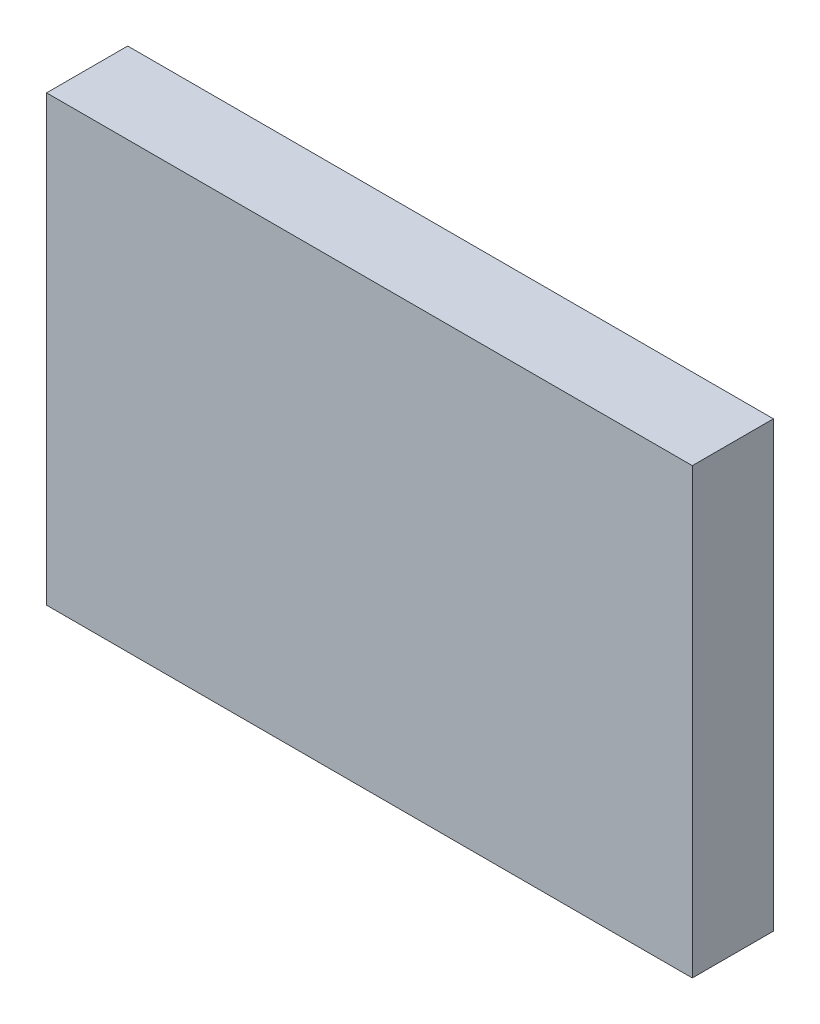
ISO-10303-21;
HEADER;
FILE_DESCRIPTION(('STEP AP214'),'2;1');
FILE_NAME('part.step','',(''),(''),'','','');
FILE_SCHEMA(('AUTOMOTIVE_DESIGN { 1 0 10303 214 1 1 1 1 }'));
ENDSEC;
DATA;
#1=APPLICATION_CONTEXT('core data for automotive mechanical design processes');
#2=APPLICATION_PROTOCOL_DEFINITION('international standard','automotive_design',2000,#1);
#3=PRODUCT_CONTEXT('',#1,'mechanical');
#4=PRODUCT('Part','Part','',(#3));
#5=PRODUCT_RELATED_PRODUCT_CATEGORY('part','',(#4));
#6=PRODUCT_DEFINITION_FORMATION('','',#4);
#7=PRODUCT_DEFINITION_CONTEXT('part definition',#1,'design');
#8=PRODUCT_DEFINITION('design','',#6,#7);
#9=PRODUCT_DEFINITION_SHAPE('','',#8);
#10=(LENGTH_UNIT() NAMED_UNIT(*) SI_UNIT(.MILLI.,.METRE.));
#11=(NAMED_UNIT(*) PLANE_ANGLE_UNIT() SI_UNIT($,.RADIAN.));
#12=(NAMED_UNIT(*) SI_UNIT($,.STERADIAN.) SOLID_ANGLE_UNIT());
#13=UNCERTAINTY_MEASURE_WITH_UNIT(LENGTH_MEASURE(1.E-05),#10,'distance_accuracy_value','');
#14=(GEOMETRIC_REPRESENTATION_CONTEXT(3) GLOBAL_UNCERTAINTY_ASSIGNED_CONTEXT((#13)) GLOBAL_UNIT_ASSIGNED_CONTEXT((#10,
#11,#12)) REPRESENTATION_CONTEXT('',''));
#15=CARTESIAN_POINT('',(0.,0.,0.));
#16=DIRECTION('',(0.,0.,1.));
#17=DIRECTION('',(1.,0.,0.));
#18=AXIS2_PLACEMENT_3D('',#15,#16,#17);
#19=CARTESIAN_POINT('',(-1.549,-1.054,0.));
#20=DIRECTION('',(0.,-1.,0.));
#21=DIRECTION('',(0.,0.,-1.));
#22=AXIS2_PLACEMENT_3D('',#19,#20,#21);
#23=PLANE('',#22);
#24=DIRECTION('',(-1.,0.,0.));
#25=VECTOR('',#24,1.);
#26=CARTESIAN_POINT('',(-1.143,-1.054,0.));
#27=LINE('',#26,#25);
#28=CARTESIAN_POINT('',(-1.143,-1.054,0.));
#29=VERTEX_POINT('',#28);
#30=CARTESIAN_POINT('',(-1.549,-1.054,0.));
#31=VERTEX_POINT('',#30);
#32=EDGE_CURVE('E11',#29,#31,#27,.T.);
#33=ORIENTED_EDGE('',*,*,#32,.F.);
#34=DIRECTION('',(0.,0.,-1.));
#35=VECTOR('',#34,1.);
#36=CARTESIAN_POINT('',(-1.143,-1.054,0.051));
#37=LINE('',#36,#35);
#38=CARTESIAN_POINT('',(-1.143,-1.054,0.051));
#39=VERTEX_POINT('',#38);
#40=EDGE_CURVE('E24',#39,#29,#37,.T.);
#41=ORIENTED_EDGE('',*,*,#40,.F.);
#42=DIRECTION('',(1.,0.,0.));
#43=VECTOR('',#42,1.);
#44=CARTESIAN_POINT('',(-1.549,-1.054,0.051));
#45=LINE('',#44,#43);
#46=CARTESIAN_POINT('',(-1.549,-1.054,0.051));
#47=VERTEX_POINT('',#46);
#48=EDGE_CURVE('E88',#47,#39,#45,.T.);
#49=ORIENTED_EDGE('',*,*,#48,.F.);
#50=DIRECTION('',(0.,0.,1.));
#51=VECTOR('',#50,1.);
#52=CARTESIAN_POINT('',(-1.549,-1.054,0.));
#53=LINE('',#52,#51);
#54=EDGE_CURVE('E77',#31,#47,#53,.T.);
#55=ORIENTED_EDGE('',*,*,#54,.F.);
#56=EDGE_LOOP('',(#33,#41,#49,#55));
#57=FACE_BOUND('',#56,.T.);
#58=ADVANCED_FACE('F17',(#57),#23,.T.);
#59=CARTESIAN_POINT('',(-1.143,-1.054,0.));
#60=DIRECTION('',(1.,0.,0.));
#61=DIRECTION('',(0.,1.,0.));
#62=AXIS2_PLACEMENT_3D('',#59,#60,#61);
#63=PLANE('',#62);
#64=DIRECTION('',(0.,-1.,0.));
#65=VECTOR('',#64,1.);
#66=CARTESIAN_POINT('',(-1.143,-0.775,0.));
#67=LINE('',#66,#65);
#68=CARTESIAN_POINT('',(-1.143,-0.775,0.));
#69=VERTEX_POINT('',#68);
#70=EDGE_CURVE('E85',#69,#29,#67,.T.);
#71=ORIENTED_EDGE('',*,*,#70,.F.);
#72=DIRECTION('',(0.,0.,-1.));
#73=VECTOR('',#72,1.);
#74=CARTESIAN_POINT('',(-1.143,-0.775,0.051));
#75=LINE('',#74,#73);
#76=CARTESIAN_POINT('',(-1.143,-0.775,0.051));
#77=VERTEX_POINT('',#76);
#78=EDGE_CURVE('E83',#77,#69,#75,.T.);
#79=ORIENTED_EDGE('',*,*,#78,.F.);
#80=DIRECTION('',(0.,1.,0.));
#81=VECTOR('',#80,1.);
#82=CARTESIAN_POINT('',(-1.143,-1.054,0.051));
#83=LINE('',#82,#81);
#84=EDGE_CURVE('E72',#39,#77,#83,.T.);
#85=ORIENTED_EDGE('',*,*,#84,.F.);
#86=ORIENTED_EDGE('',*,*,#40,.T.);
#87=EDGE_LOOP('',(#71,#79,#85,#86));
#88=FACE_BOUND('',#87,.T.);
#89=ADVANCED_FACE('F90',(#88),#63,.T.);
#90=CARTESIAN_POINT('',(-1.143,-0.775,0.));
#91=DIRECTION('',(0.,1.,0.));
#92=DIRECTION('',(1.,0.,0.));
#93=AXIS2_PLACEMENT_3D('',#90,#91,#92);
#94=PLANE('',#93);
#95=DIRECTION('',(1.,0.,0.));
#96=VECTOR('',#95,1.);
#97=CARTESIAN_POINT('',(-1.549,-0.775,0.));
#98=LINE('',#97,#96);
#99=CARTESIAN_POINT('',(-1.549,-0.775,0.));
#100=VERTEX_POINT('',#99);
#101=EDGE_CURVE('E60',#100,#69,#98,.T.);
#102=ORIENTED_EDGE('',*,*,#101,.F.);
#103=DIRECTION('',(0.,0.,-1.));
#104=VECTOR('',#103,1.);
#105=CARTESIAN_POINT('',(-1.549,-0.775,0.051));
#106=LINE('',#105,#104);
#107=CARTESIAN_POINT('',(-1.549,-0.775,0.051));
#108=VERTEX_POINT('',#107);
#109=EDGE_CURVE('E54',#108,#100,#106,.T.);
#110=ORIENTED_EDGE('',*,*,#109,.F.);
#111=DIRECTION('',(-1.,0.,0.));
#112=VECTOR('',#111,1.);
#113=CARTESIAN_POINT('',(-1.143,-0.775,0.051));
#114=LINE('',#113,#112);
#115=EDGE_CURVE('E58',#77,#108,#114,.T.);
#116=ORIENTED_EDGE('',*,*,#115,.F.);
#117=ORIENTED_EDGE('',*,*,#78,.T.);
#118=EDGE_LOOP('',(#102,#110,#116,#117));
#119=FACE_BOUND('',#118,.T.);
#120=ADVANCED_FACE('F56',(#119),#94,.T.);
#121=CARTESIAN_POINT('',(-1.549,-0.775,0.));
#122=DIRECTION('',(-1.,0.,0.));
#123=DIRECTION('',(0.,0.,1.));
#124=AXIS2_PLACEMENT_3D('',#121,#122,#123);
#125=PLANE('',#124);
#126=DIRECTION('',(0.,1.,0.));
#127=VECTOR('',#126,1.);
#128=CARTESIAN_POINT('',(-1.549,-1.054,0.));
#129=LINE('',#128,#127);
#130=EDGE_CURVE('E73',#31,#100,#129,.T.);
#131=ORIENTED_EDGE('',*,*,#130,.F.);
#132=ORIENTED_EDGE('',*,*,#54,.T.);
#133=DIRECTION('',(0.,-1.,0.));
#134=VECTOR('',#133,1.);
#135=CARTESIAN_POINT('',(-1.549,-0.775,0.051));
#136=LINE('',#135,#134);
#137=EDGE_CURVE('E70',#108,#47,#136,.T.);
#138=ORIENTED_EDGE('',*,*,#137,.F.);
#139=ORIENTED_EDGE('',*,*,#109,.T.);
#140=EDGE_LOOP('',(#131,#132,#138,#139));
#141=FACE_BOUND('',#140,.T.);
#142=ADVANCED_FACE('F76',(#141),#125,.T.);
#143=CARTESIAN_POINT('',(-1.549,-0.775,0.));
#144=DIRECTION('',(0.,0.,-1.));
#145=DIRECTION('',(0.,-1.,0.));
#146=AXIS2_PLACEMENT_3D('',#143,#144,#145);
#147=PLANE('',#146);
#148=ORIENTED_EDGE('',*,*,#101,.T.);
#149=ORIENTED_EDGE('',*,*,#70,.T.);
#150=ORIENTED_EDGE('',*,*,#32,.T.);
#151=ORIENTED_EDGE('',*,*,#130,.T.);
#152=EDGE_LOOP('',(#148,#149,#150,#151));
#153=FACE_BOUND('',#152,.T.);
#154=ADVANCED_FACE('F91',(#153),#147,.T.);
#155=CARTESIAN_POINT('',(-1.549,-1.054,0.051));
#156=DIRECTION('',(0.,0.,1.));
#157=DIRECTION('',(1.,0.,0.));
#158=AXIS2_PLACEMENT_3D('',#155,#156,#157);
#159=PLANE('',#158);
#160=ORIENTED_EDGE('',*,*,#48,.T.);
#161=ORIENTED_EDGE('',*,*,#84,.T.);
#162=ORIENTED_EDGE('',*,*,#115,.T.);
#163=ORIENTED_EDGE('',*,*,#137,.T.);
#164=EDGE_LOOP('',(#160,#161,#162,#163));
#165=FACE_BOUND('',#164,.T.);
#166=ADVANCED_FACE('F69',(#165),#159,.T.);
#167=CLOSED_SHELL('',(#58,#89,#120,#142,#154,#166));
#168=MANIFOLD_SOLID_BREP('B1',#167);
#169=ADVANCED_BREP_SHAPE_REPRESENTATION('',(#18,#168),#14);
#170=SHAPE_DEFINITION_REPRESENTATION(#9,#169);
ENDSEC;
END-ISO-10303-21;
